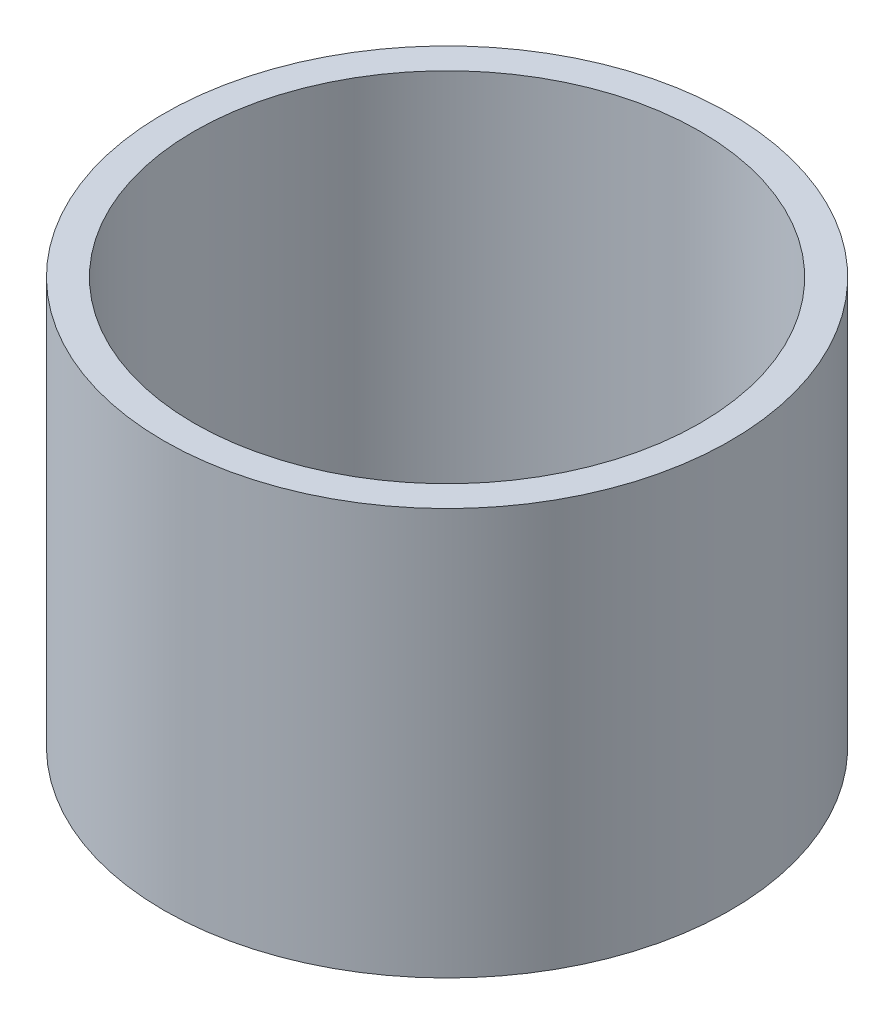
ISO-10303-21;
HEADER;
FILE_DESCRIPTION(('STEP AP214'),'2;1');
FILE_NAME('part.step','',(''),(''),'','','');
FILE_SCHEMA(('AUTOMOTIVE_DESIGN { 1 0 10303 214 1 1 1 1 }'));
ENDSEC;
DATA;
#1=APPLICATION_CONTEXT('core data for automotive mechanical design processes');
#2=APPLICATION_PROTOCOL_DEFINITION('international standard','automotive_design',2000,#1);
#3=PRODUCT_CONTEXT('',#1,'mechanical');
#4=PRODUCT('Part','Part','',(#3));
#5=PRODUCT_RELATED_PRODUCT_CATEGORY('part','',(#4));
#6=PRODUCT_DEFINITION_FORMATION('','',#4);
#7=PRODUCT_DEFINITION_CONTEXT('part definition',#1,'design');
#8=PRODUCT_DEFINITION('design','',#6,#7);
#9=PRODUCT_DEFINITION_SHAPE('','',#8);
#10=(LENGTH_UNIT() NAMED_UNIT(*) SI_UNIT(.MILLI.,.METRE.));
#11=(NAMED_UNIT(*) PLANE_ANGLE_UNIT() SI_UNIT($,.RADIAN.));
#12=(NAMED_UNIT(*) SI_UNIT($,.STERADIAN.) SOLID_ANGLE_UNIT());
#13=UNCERTAINTY_MEASURE_WITH_UNIT(LENGTH_MEASURE(1.E-05),#10,'distance_accuracy_value','');
#14=(GEOMETRIC_REPRESENTATION_CONTEXT(3) GLOBAL_UNCERTAINTY_ASSIGNED_CONTEXT((#13)) GLOBAL_UNIT_ASSIGNED_CONTEXT((#10,
#11,#12)) REPRESENTATION_CONTEXT('',''));
#15=CARTESIAN_POINT('',(0.,0.,0.));
#16=DIRECTION('',(0.,0.,1.));
#17=DIRECTION('',(1.,0.,0.));
#18=AXIS2_PLACEMENT_3D('',#15,#16,#17);
#19=CARTESIAN_POINT('',(0.,60.9872923477304,0.));
#20=DIRECTION('',(0.,-1.,0.));
#21=DIRECTION('',(0.,0.,-1.));
#22=AXIS2_PLACEMENT_3D('',#19,#20,#21);
#23=CYLINDRICAL_SURFACE('',#22,42.5);
#24=CARTESIAN_POINT('',(0.,60.9872923477304,0.));
#25=DIRECTION('',(0.,1.,0.));
#26=DIRECTION('',(0.,0.,1.));
#27=AXIS2_PLACEMENT_3D('',#24,#25,#26);
#28=CIRCLE('',#27,42.5);
#29=CARTESIAN_POINT('',(0.,60.9872923477304,42.5));
#30=VERTEX_POINT('',#29);
#31=EDGE_CURVE('E10',#30,#30,#28,.T.);
#32=ORIENTED_EDGE('',*,*,#31,.F.);
#33=EDGE_LOOP('',(#32));
#34=FACE_BOUND('',#33,.T.);
#35=CARTESIAN_POINT('',(0.,0.,0.));
#36=DIRECTION('',(0.,1.,0.));
#37=DIRECTION('',(0.,0.,1.));
#38=AXIS2_PLACEMENT_3D('',#35,#36,#37);
#39=CIRCLE('',#38,42.5);
#40=CARTESIAN_POINT('',(0.,0.,42.5));
#41=VERTEX_POINT('',#40);
#42=EDGE_CURVE('E37',#41,#41,#39,.T.);
#43=ORIENTED_EDGE('',*,*,#42,.T.);
#44=EDGE_LOOP('',(#43));
#45=FACE_BOUND('',#44,.T.);
#46=ADVANCED_FACE('F40',(#34,#45),#23,.T.);
#47=CARTESIAN_POINT('',(0.,60.9872923477304,0.));
#48=DIRECTION('',(0.,1.,0.));
#49=DIRECTION('',(0.,0.,1.));
#50=AXIS2_PLACEMENT_3D('',#47,#48,#49);
#51=PLANE('',#50);
#52=CARTESIAN_POINT('',(0.,60.9872923477304,0.));
#53=DIRECTION('',(0.,1.,0.));
#54=DIRECTION('',(0.,0.,1.));
#55=AXIS2_PLACEMENT_3D('',#52,#53,#54);
#56=CIRCLE('',#55,37.939240808561);
#57=CARTESIAN_POINT('',(0.,60.9872923477304,37.939240808561));
#58=VERTEX_POINT('',#57);
#59=EDGE_CURVE('E50',#58,#58,#56,.T.);
#60=ORIENTED_EDGE('',*,*,#59,.F.);
#61=EDGE_LOOP('',(#60));
#62=FACE_BOUND('',#61,.T.);
#63=ORIENTED_EDGE('',*,*,#31,.T.);
#64=EDGE_LOOP('',(#63));
#65=FACE_BOUND('',#64,.T.);
#66=ADVANCED_FACE('F59',(#62,#65),#51,.T.);
#67=CARTESIAN_POINT('',(0.,0.,0.));
#68=DIRECTION('',(0.,1.,0.));
#69=DIRECTION('',(0.,0.,1.));
#70=AXIS2_PLACEMENT_3D('',#67,#68,#69);
#71=PLANE('',#70);
#72=CARTESIAN_POINT('',(0.,0.,0.));
#73=DIRECTION('',(0.,1.,0.));
#74=DIRECTION('',(0.,0.,1.));
#75=AXIS2_PLACEMENT_3D('',#72,#73,#74);
#76=CIRCLE('',#75,37.939240808561);
#77=CARTESIAN_POINT('',(0.,0.,37.939240808561));
#78=VERTEX_POINT('',#77);
#79=EDGE_CURVE('E47',#78,#78,#76,.T.);
#80=ORIENTED_EDGE('',*,*,#79,.T.);
#81=EDGE_LOOP('',(#80));
#82=FACE_BOUND('',#81,.T.);
#83=ORIENTED_EDGE('',*,*,#42,.F.);
#84=EDGE_LOOP('',(#83));
#85=FACE_BOUND('',#84,.T.);
#86=ADVANCED_FACE('F58',(#82,#85),#71,.F.);
#87=CARTESIAN_POINT('',(0.,60.9872923477304,0.));
#88=DIRECTION('',(0.,-1.,0.));
#89=DIRECTION('',(0.,0.,-1.));
#90=AXIS2_PLACEMENT_3D('',#87,#88,#89);
#91=CYLINDRICAL_SURFACE('',#90,37.939240808561);
#92=ORIENTED_EDGE('',*,*,#59,.T.);
#93=EDGE_LOOP('',(#92));
#94=FACE_BOUND('',#93,.T.);
#95=ORIENTED_EDGE('',*,*,#79,.F.);
#96=EDGE_LOOP('',(#95));
#97=FACE_BOUND('',#96,.T.);
#98=ADVANCED_FACE('F54',(#94,#97),#91,.F.);
#99=CLOSED_SHELL('',(#46,#66,#86,#98));
#100=MANIFOLD_SOLID_BREP('B2',#99);
#101=ADVANCED_BREP_SHAPE_REPRESENTATION('',(#18,#100),#14);
#102=SHAPE_DEFINITION_REPRESENTATION(#9,#101);
ENDSEC;
END-ISO-10303-21;
